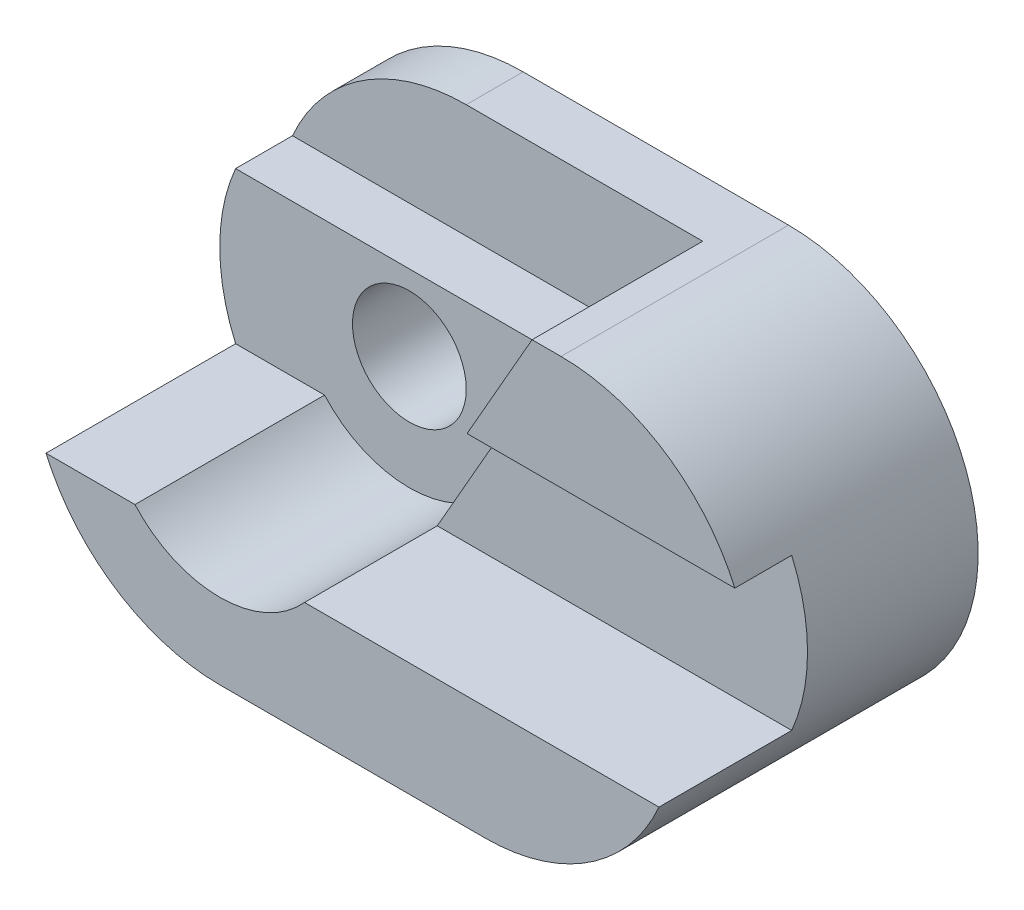
ISO-10303-21;
HEADER;
FILE_DESCRIPTION(('STEP AP214'),'2;1');
FILE_NAME('part.step','',(''),(''),'','','');
FILE_SCHEMA(('AUTOMOTIVE_DESIGN { 1 0 10303 214 1 1 1 1 }'));
ENDSEC;
DATA;
#1=APPLICATION_CONTEXT('core data for automotive mechanical design processes');
#2=APPLICATION_PROTOCOL_DEFINITION('international standard','automotive_design',2000,#1);
#3=PRODUCT_CONTEXT('',#1,'mechanical');
#4=PRODUCT('Part','Part','',(#3));
#5=PRODUCT_RELATED_PRODUCT_CATEGORY('part','',(#4));
#6=PRODUCT_DEFINITION_FORMATION('','',#4);
#7=PRODUCT_DEFINITION_CONTEXT('part definition',#1,'design');
#8=PRODUCT_DEFINITION('design','',#6,#7);
#9=PRODUCT_DEFINITION_SHAPE('','',#8);
#10=(LENGTH_UNIT() NAMED_UNIT(*) SI_UNIT(.MILLI.,.METRE.));
#11=(NAMED_UNIT(*) PLANE_ANGLE_UNIT() SI_UNIT($,.RADIAN.));
#12=(NAMED_UNIT(*) SI_UNIT($,.STERADIAN.) SOLID_ANGLE_UNIT());
#13=UNCERTAINTY_MEASURE_WITH_UNIT(LENGTH_MEASURE(1.E-05),#10,'distance_accuracy_value','');
#14=(GEOMETRIC_REPRESENTATION_CONTEXT(3) GLOBAL_UNCERTAINTY_ASSIGNED_CONTEXT((#13)) GLOBAL_UNIT_ASSIGNED_CONTEXT((#10,
#11,#12)) REPRESENTATION_CONTEXT('',''));
#15=CARTESIAN_POINT('',(0.,0.,0.));
#16=DIRECTION('',(0.,0.,1.));
#17=DIRECTION('',(1.,0.,0.));
#18=AXIS2_PLACEMENT_3D('',#15,#16,#17);
#19=CARTESIAN_POINT('',(-3.5,0.,8.));
#20=DIRECTION('',(0.,0.,-1.));
#21=DIRECTION('',(-1.,0.,0.));
#22=AXIS2_PLACEMENT_3D('',#19,#20,#21);
#23=CYLINDRICAL_SURFACE('',#22,1.5);
#24=CARTESIAN_POINT('',(-3.5,0.,0.));
#25=DIRECTION('',(0.,0.,1.));
#26=DIRECTION('',(1.,0.,0.));
#27=AXIS2_PLACEMENT_3D('',#24,#25,#26);
#28=CIRCLE('',#27,1.5);
#29=CARTESIAN_POINT('',(-2.,0.,0.));
#30=VERTEX_POINT('',#29);
#31=EDGE_CURVE('E197',#30,#30,#28,.T.);
#32=ORIENTED_EDGE('',*,*,#31,.F.);
#33=EDGE_LOOP('',(#32));
#34=FACE_BOUND('',#33,.T.);
#35=CARTESIAN_POINT('',(-3.5,0.,3.));
#36=DIRECTION('',(0.,0.,1.));
#37=DIRECTION('',(1.,0.,0.));
#38=AXIS2_PLACEMENT_3D('',#35,#36,#37);
#39=CIRCLE('',#38,1.5);
#40=CARTESIAN_POINT('',(-2.,0.,3.));
#41=VERTEX_POINT('',#40);
#42=EDGE_CURVE('E37',#41,#41,#39,.T.);
#43=ORIENTED_EDGE('',*,*,#42,.T.);
#44=EDGE_LOOP('',(#43));
#45=FACE_BOUND('',#44,.T.);
#46=ADVANCED_FACE('F33',(#34,#45),#23,.F.);
#47=CARTESIAN_POINT('',(18.,-2.,8.));
#48=DIRECTION('',(0.,1.,0.));
#49=DIRECTION('',(0.,0.,1.));
#50=AXIS2_PLACEMENT_3D('',#47,#48,#49);
#51=PLANE('',#50);
#52=DIRECTION('',(0.,0.,1.));
#53=VECTOR('',#52,1.);
#54=CARTESIAN_POINT('',(-5.73606797749979,-2.,3.));
#55=LINE('',#54,#53);
#56=CARTESIAN_POINT('',(-5.73606797749979,-2.,3.));
#57=VERTEX_POINT('',#56);
#58=CARTESIAN_POINT('',(-5.73606797749979,-2.,8.));
#59=VERTEX_POINT('',#58);
#60=EDGE_CURVE('E167',#57,#59,#55,.T.);
#61=ORIENTED_EDGE('',*,*,#60,.F.);
#62=DIRECTION('',(1.,0.,0.));
#63=VECTOR('',#62,1.);
#64=CARTESIAN_POINT('',(-10.7871921532877,-2.,3.));
#65=LINE('',#64,#63);
#66=CARTESIAN_POINT('',(-8.08257569495584,-2.,3.));
#67=VERTEX_POINT('',#66);
#68=EDGE_CURVE('E162',#67,#57,#65,.T.);
#69=ORIENTED_EDGE('',*,*,#68,.F.);
#70=DIRECTION('',(0.,0.,-1.));
#71=VECTOR('',#70,1.);
#72=CARTESIAN_POINT('',(-8.08257569495584,-2.,8.));
#73=LINE('',#72,#71);
#74=CARTESIAN_POINT('',(-8.08257569495584,-2.,8.));
#75=VERTEX_POINT('',#74);
#76=EDGE_CURVE('E194',#67,#75,#73,.F.);
#77=ORIENTED_EDGE('',*,*,#76,.T.);
#78=DIRECTION('',(-1.,0.,0.));
#79=VECTOR('',#78,1.);
#80=CARTESIAN_POINT('',(18.,-2.,8.));
#81=LINE('',#80,#79);
#82=EDGE_CURVE('E186',#59,#75,#81,.T.);
#83=ORIENTED_EDGE('',*,*,#82,.F.);
#84=EDGE_LOOP('',(#61,#69,#77,#83));
#85=FACE_BOUND('',#84,.T.);
#86=ADVANCED_FACE('F293',(#85),#51,.T.);
#87=CARTESIAN_POINT('',(-3.5,0.,8.));
#88=DIRECTION('',(0.,0.,1.));
#89=DIRECTION('',(1.,0.,0.));
#90=AXIS2_PLACEMENT_3D('',#87,#88,#89);
#91=PLANE('',#90);
#92=CARTESIAN_POINT('',(-3.5,0.,8.));
#93=DIRECTION('',(0.,0.,1.));
#94=DIRECTION('',(1.,0.,0.));
#95=AXIS2_PLACEMENT_3D('',#92,#93,#94);
#96=CIRCLE('',#95,3.);
#97=CARTESIAN_POINT('',(-1.26393202250021,-2.,8.));
#98=VERTEX_POINT('',#97);
#99=EDGE_CURVE('E156',#59,#98,#96,.T.);
#100=ORIENTED_EDGE('',*,*,#99,.F.);
#101=ORIENTED_EDGE('',*,*,#82,.T.);
#102=CARTESIAN_POINT('',(-3.5,0.,8.));
#103=DIRECTION('',(0.,0.,1.));
#104=DIRECTION('',(1.,0.,0.));
#105=AXIS2_PLACEMENT_3D('',#102,#103,#104);
#106=CIRCLE('',#105,5.);
#107=CARTESIAN_POINT('',(-3.5,-5.,8.));
#108=VERTEX_POINT('',#107);
#109=EDGE_CURVE('E201',#75,#108,#106,.T.);
#110=ORIENTED_EDGE('',*,*,#109,.T.);
#111=DIRECTION('',(1.,0.,0.));
#112=VECTOR('',#111,1.);
#113=CARTESIAN_POINT('',(-3.5,-5.,8.));
#114=LINE('',#113,#112);
#115=CARTESIAN_POINT('',(3.5,-5.,8.));
#116=VERTEX_POINT('',#115);
#117=EDGE_CURVE('E203',#108,#116,#114,.T.);
#118=ORIENTED_EDGE('',*,*,#117,.T.);
#119=CARTESIAN_POINT('',(3.5,0.,8.));
#120=DIRECTION('',(0.,0.,1.));
#121=DIRECTION('',(1.,0.,0.));
#122=AXIS2_PLACEMENT_3D('',#119,#120,#121);
#123=CIRCLE('',#122,5.);
#124=CARTESIAN_POINT('',(8.08257569495584,-2.,8.));
#125=VERTEX_POINT('',#124);
#126=EDGE_CURVE('E206',#116,#125,#123,.T.);
#127=ORIENTED_EDGE('',*,*,#126,.T.);
#128=EDGE_CURVE('E187',#125,#98,#81,.T.);
#129=ORIENTED_EDGE('',*,*,#128,.T.);
#130=EDGE_LOOP('',(#100,#101,#110,#118,#127,#129));
#131=FACE_BOUND('',#130,.T.);
#132=ADVANCED_FACE('F272',(#131),#91,.T.);
#133=CARTESIAN_POINT('',(-3.5,0.,8.));
#134=DIRECTION('',(0.,0.,-1.));
#135=DIRECTION('',(-1.,0.,0.));
#136=AXIS2_PLACEMENT_3D('',#133,#134,#135);
#137=CYLINDRICAL_SURFACE('',#136,5.);
#138=CARTESIAN_POINT('',(-3.5,0.,3.));
#139=DIRECTION('',(0.,0.,1.));
#140=DIRECTION('',(1.,0.,0.));
#141=AXIS2_PLACEMENT_3D('',#138,#139,#140);
#142=CIRCLE('',#141,5.);
#143=CARTESIAN_POINT('',(-8.08257569495584,2.,3.));
#144=VERTEX_POINT('',#143);
#145=EDGE_CURVE('E175',#144,#67,#142,.T.);
#146=ORIENTED_EDGE('',*,*,#145,.F.);
#147=DIRECTION('',(0.,0.,-1.));
#148=VECTOR('',#147,1.);
#149=CARTESIAN_POINT('',(-8.08257569495584,2.,8.));
#150=LINE('',#149,#148);
#151=CARTESIAN_POINT('',(-8.08257569495584,2.,1.5));
#152=VERTEX_POINT('',#151);
#153=EDGE_CURVE('E144',#144,#152,#150,.T.);
#154=ORIENTED_EDGE('',*,*,#153,.T.);
#155=CARTESIAN_POINT('',(-3.5,0.,1.5));
#156=DIRECTION('',(0.,0.,-1.));
#157=DIRECTION('',(-1.,0.,0.));
#158=AXIS2_PLACEMENT_3D('',#155,#156,#157);
#159=CIRCLE('',#158,5.);
#160=CARTESIAN_POINT('',(-3.5,5.,1.5));
#161=VERTEX_POINT('',#160);
#162=EDGE_CURVE('E136',#152,#161,#159,.T.);
#163=ORIENTED_EDGE('',*,*,#162,.T.);
#164=DIRECTION('',(0.,0.,-1.));
#165=VECTOR('',#164,1.);
#166=CARTESIAN_POINT('',(-3.5,5.,8.));
#167=LINE('',#166,#165);
#168=CARTESIAN_POINT('',(-3.5,5.,0.));
#169=VERTEX_POINT('',#168);
#170=EDGE_CURVE('E209',#161,#169,#167,.T.);
#171=ORIENTED_EDGE('',*,*,#170,.T.);
#172=CARTESIAN_POINT('',(-3.5,0.,0.));
#173=DIRECTION('',(0.,0.,1.));
#174=DIRECTION('',(1.,0.,0.));
#175=AXIS2_PLACEMENT_3D('',#172,#173,#174);
#176=CIRCLE('',#175,5.);
#177=CARTESIAN_POINT('',(-3.5,-5.,0.));
#178=VERTEX_POINT('',#177);
#179=EDGE_CURVE('E200',#169,#178,#176,.T.);
#180=ORIENTED_EDGE('',*,*,#179,.T.);
#181=DIRECTION('',(0.,0.,-1.));
#182=VECTOR('',#181,1.);
#183=CARTESIAN_POINT('',(-3.5,-5.,8.));
#184=LINE('',#183,#182);
#185=EDGE_CURVE('E225',#108,#178,#184,.T.);
#186=ORIENTED_EDGE('',*,*,#185,.F.);
#187=ORIENTED_EDGE('',*,*,#109,.F.);
#188=ORIENTED_EDGE('',*,*,#76,.F.);
#189=EDGE_LOOP('',(#146,#154,#163,#171,#180,#186,#187,#188));
#190=FACE_BOUND('',#189,.T.);
#191=ADVANCED_FACE('F35',(#190),#137,.T.);
#192=CARTESIAN_POINT('',(3.5,0.,8.));
#193=DIRECTION('',(0.,0.,-1.));
#194=DIRECTION('',(-1.,0.,0.));
#195=AXIS2_PLACEMENT_3D('',#192,#193,#194);
#196=CYLINDRICAL_SURFACE('',#195,5.);
#197=DIRECTION('',(0.,0.,-1.));
#198=VECTOR('',#197,1.);
#199=CARTESIAN_POINT('',(8.08257569495584,-2.,8.));
#200=LINE('',#199,#198);
#201=CARTESIAN_POINT('',(8.08257569495584,-2.,4.5));
#202=VERTEX_POINT('',#201);
#203=EDGE_CURVE('E42',#125,#202,#200,.T.);
#204=ORIENTED_EDGE('',*,*,#203,.F.);
#205=ORIENTED_EDGE('',*,*,#126,.F.);
#206=DIRECTION('',(0.,0.,-1.));
#207=VECTOR('',#206,1.);
#208=CARTESIAN_POINT('',(3.5,-5.,8.));
#209=LINE('',#208,#207);
#210=CARTESIAN_POINT('',(3.5,-5.,0.));
#211=VERTEX_POINT('',#210);
#212=EDGE_CURVE('E222',#116,#211,#209,.T.);
#213=ORIENTED_EDGE('',*,*,#212,.T.);
#214=CARTESIAN_POINT('',(3.5,0.,0.));
#215=DIRECTION('',(0.,0.,1.));
#216=DIRECTION('',(1.,0.,0.));
#217=AXIS2_PLACEMENT_3D('',#214,#215,#216);
#218=CIRCLE('',#217,5.);
#219=CARTESIAN_POINT('',(3.5,5.,0.));
#220=VERTEX_POINT('',#219);
#221=EDGE_CURVE('E214',#211,#220,#218,.T.);
#222=ORIENTED_EDGE('',*,*,#221,.T.);
#223=DIRECTION('',(0.,0.,-1.));
#224=VECTOR('',#223,1.);
#225=CARTESIAN_POINT('',(3.5,5.,8.));
#226=LINE('',#225,#224);
#227=CARTESIAN_POINT('',(3.5,5.,6.));
#228=VERTEX_POINT('',#227);
#229=EDGE_CURVE('E220',#228,#220,#226,.T.);
#230=ORIENTED_EDGE('',*,*,#229,.F.);
#231=CARTESIAN_POINT('',(3.5,0.,6.));
#232=DIRECTION('',(0.,0.,1.));
#233=DIRECTION('',(1.,0.,0.));
#234=AXIS2_PLACEMENT_3D('',#231,#232,#233);
#235=CIRCLE('',#234,5.);
#236=CARTESIAN_POINT('',(8.08257569495584,2.,6.));
#237=VERTEX_POINT('',#236);
#238=EDGE_CURVE('E192',#237,#228,#235,.T.);
#239=ORIENTED_EDGE('',*,*,#238,.F.);
#240=DIRECTION('',(0.,0.,-1.));
#241=VECTOR('',#240,1.);
#242=CARTESIAN_POINT('',(8.08257569495584,2.,8.));
#243=LINE('',#242,#241);
#244=CARTESIAN_POINT('',(8.08257569495584,2.,4.5));
#245=VERTEX_POINT('',#244);
#246=EDGE_CURVE('E231',#245,#237,#243,.F.);
#247=ORIENTED_EDGE('',*,*,#246,.F.);
#248=CARTESIAN_POINT('',(3.5,0.,4.5));
#249=DIRECTION('',(0.,0.,1.));
#250=DIRECTION('',(1.,0.,0.));
#251=AXIS2_PLACEMENT_3D('',#248,#249,#250);
#252=CIRCLE('',#251,5.);
#253=EDGE_CURVE('E190',#202,#245,#252,.T.);
#254=ORIENTED_EDGE('',*,*,#253,.F.);
#255=EDGE_LOOP('',(#204,#205,#213,#222,#230,#239,#247,#254));
#256=FACE_BOUND('',#255,.T.);
#257=ADVANCED_FACE('F246',(#256),#196,.T.);
#258=CARTESIAN_POINT('',(-3.5,5.,8.));
#259=DIRECTION('',(0.,-1.,0.));
#260=DIRECTION('',(1.,0.,0.));
#261=AXIS2_PLACEMENT_3D('',#258,#259,#260);
#262=PLANE('',#261);
#263=DIRECTION('',(-1.,0.,0.));
#264=VECTOR('',#263,1.);
#265=CARTESIAN_POINT('',(2.73606797749979,5.,1.5));
#266=LINE('',#265,#264);
#267=CARTESIAN_POINT('',(2.73606797749979,5.,1.5));
#268=VERTEX_POINT('',#267);
#269=EDGE_CURVE('E145',#268,#161,#266,.T.);
#270=ORIENTED_EDGE('',*,*,#269,.F.);
#271=DIRECTION('',(0.,0.,1.));
#272=VECTOR('',#271,1.);
#273=CARTESIAN_POINT('',(2.73606797749979,5.,3.));
#274=LINE('',#273,#272);
#275=CARTESIAN_POINT('',(2.73606797749979,5.,6.));
#276=VERTEX_POINT('',#275);
#277=EDGE_CURVE('E149',#268,#276,#274,.T.);
#278=ORIENTED_EDGE('',*,*,#277,.T.);
#279=DIRECTION('',(-1.,0.,0.));
#280=VECTOR('',#279,1.);
#281=CARTESIAN_POINT('',(-3.5,5.,6.));
#282=LINE('',#281,#280);
#283=EDGE_CURVE('E228',#228,#276,#282,.T.);
#284=ORIENTED_EDGE('',*,*,#283,.F.);
#285=ORIENTED_EDGE('',*,*,#229,.T.);
#286=DIRECTION('',(-1.,0.,0.));
#287=VECTOR('',#286,1.);
#288=CARTESIAN_POINT('',(-3.5,5.,0.));
#289=LINE('',#288,#287);
#290=EDGE_CURVE('E204',#220,#169,#289,.T.);
#291=ORIENTED_EDGE('',*,*,#290,.T.);
#292=ORIENTED_EDGE('',*,*,#170,.F.);
#293=EDGE_LOOP('',(#270,#278,#284,#285,#291,#292));
#294=FACE_BOUND('',#293,.T.);
#295=ADVANCED_FACE('F258',(#294),#262,.F.);
#296=CARTESIAN_POINT('',(-3.5,0.,0.));
#297=DIRECTION('',(0.,0.,1.));
#298=DIRECTION('',(1.,0.,0.));
#299=AXIS2_PLACEMENT_3D('',#296,#297,#298);
#300=PLANE('',#299);
#301=ORIENTED_EDGE('',*,*,#179,.F.);
#302=ORIENTED_EDGE('',*,*,#290,.F.);
#303=ORIENTED_EDGE('',*,*,#221,.F.);
#304=DIRECTION('',(1.,0.,0.));
#305=VECTOR('',#304,1.);
#306=CARTESIAN_POINT('',(-3.5,-5.,0.));
#307=LINE('',#306,#305);
#308=EDGE_CURVE('E212',#178,#211,#307,.T.);
#309=ORIENTED_EDGE('',*,*,#308,.F.);
#310=EDGE_LOOP('',(#301,#302,#303,#309));
#311=FACE_BOUND('',#310,.T.);
#312=ORIENTED_EDGE('',*,*,#31,.T.);
#313=EDGE_LOOP('',(#312));
#314=FACE_BOUND('',#313,.T.);
#315=ADVANCED_FACE('F281',(#311,#314),#300,.F.);
#316=CARTESIAN_POINT('',(-3.5,-5.,8.));
#317=DIRECTION('',(0.,1.,0.));
#318=DIRECTION('',(-1.,0.,0.));
#319=AXIS2_PLACEMENT_3D('',#316,#317,#318);
#320=PLANE('',#319);
#321=ORIENTED_EDGE('',*,*,#308,.T.);
#322=ORIENTED_EDGE('',*,*,#212,.F.);
#323=ORIENTED_EDGE('',*,*,#117,.F.);
#324=ORIENTED_EDGE('',*,*,#185,.T.);
#325=EDGE_LOOP('',(#321,#322,#323,#324));
#326=FACE_BOUND('',#325,.T.);
#327=ADVANCED_FACE('F285',(#326),#320,.F.);
#328=DIRECTION('',(0.,0.,1.));
#329=VECTOR('',#328,1.);
#330=CARTESIAN_POINT('',(-1.26393202250021,-2.,3.));
#331=LINE('',#330,#329);
#332=CARTESIAN_POINT('',(-1.26393202250021,-2.,4.5));
#333=VERTEX_POINT('',#332);
#334=EDGE_CURVE('E165',#333,#98,#331,.T.);
#335=ORIENTED_EDGE('',*,*,#334,.T.);
#336=ORIENTED_EDGE('',*,*,#128,.F.);
#337=ORIENTED_EDGE('',*,*,#203,.T.);
#338=DIRECTION('',(-1.,0.,0.));
#339=VECTOR('',#338,1.);
#340=CARTESIAN_POINT('',(18.,-2.,4.5));
#341=LINE('',#340,#339);
#342=EDGE_CURVE('E183',#202,#333,#341,.T.);
#343=ORIENTED_EDGE('',*,*,#342,.T.);
#344=EDGE_LOOP('',(#335,#336,#337,#343));
#345=FACE_BOUND('',#344,.T.);
#346=ADVANCED_FACE('F237',(#345),#51,.T.);
#347=CARTESIAN_POINT('',(18.,2.,4.5));
#348=DIRECTION('',(0.,-1.,0.));
#349=DIRECTION('',(0.,0.,-1.));
#350=AXIS2_PLACEMENT_3D('',#347,#348,#349);
#351=PLANE('',#350);
#352=DIRECTION('',(0.,0.,1.));
#353=VECTOR('',#352,1.);
#354=CARTESIAN_POINT('',(1.02178226321407,2.,4.5));
#355=LINE('',#354,#353);
#356=CARTESIAN_POINT('',(1.02178226321407,2.,4.5));
#357=VERTEX_POINT('',#356);
#358=CARTESIAN_POINT('',(1.02178226321407,2.,6.));
#359=VERTEX_POINT('',#358);
#360=EDGE_CURVE('E169',#357,#359,#355,.T.);
#361=ORIENTED_EDGE('',*,*,#360,.F.);
#362=DIRECTION('',(-1.,0.,0.));
#363=VECTOR('',#362,1.);
#364=CARTESIAN_POINT('',(18.,2.,4.5));
#365=LINE('',#364,#363);
#366=EDGE_CURVE('E180',#245,#357,#365,.T.);
#367=ORIENTED_EDGE('',*,*,#366,.F.);
#368=ORIENTED_EDGE('',*,*,#246,.T.);
#369=DIRECTION('',(-1.,0.,0.));
#370=VECTOR('',#369,1.);
#371=CARTESIAN_POINT('',(18.,2.,6.));
#372=LINE('',#371,#370);
#373=EDGE_CURVE('E177',#237,#359,#372,.T.);
#374=ORIENTED_EDGE('',*,*,#373,.T.);
#375=EDGE_LOOP('',(#361,#367,#368,#374));
#376=FACE_BOUND('',#375,.T.);
#377=ADVANCED_FACE('F252',(#376),#351,.T.);
#378=CARTESIAN_POINT('',(18.,2.,6.));
#379=DIRECTION('',(0.,0.,1.));
#380=DIRECTION('',(1.,0.,0.));
#381=AXIS2_PLACEMENT_3D('',#378,#379,#380);
#382=PLANE('',#381);
#383=DIRECTION('',(0.496138938356834,0.868243142124459,0.));
#384=VECTOR('',#383,1.);
#385=CARTESIAN_POINT('',(5.20103585996138,9.31369379430778,6.));
#386=LINE('',#385,#384);
#387=EDGE_CURVE('E173',#359,#276,#386,.T.);
#388=ORIENTED_EDGE('',*,*,#387,.F.);
#389=ORIENTED_EDGE('',*,*,#373,.F.);
#390=ORIENTED_EDGE('',*,*,#238,.T.);
#391=ORIENTED_EDGE('',*,*,#283,.T.);
#392=EDGE_LOOP('',(#388,#389,#390,#391));
#393=FACE_BOUND('',#392,.T.);
#394=ADVANCED_FACE('F255',(#393),#382,.T.);
#395=CARTESIAN_POINT('',(18.,-2.,4.5));
#396=DIRECTION('',(0.,0.,1.));
#397=DIRECTION('',(1.,0.,0.));
#398=AXIS2_PLACEMENT_3D('',#395,#396,#397);
#399=PLANE('',#398);
#400=DIRECTION('',(0.496138938356834,0.868243142124459,0.));
#401=VECTOR('',#400,1.);
#402=CARTESIAN_POINT('',(3.47795893688445,6.29830917892317,4.5));
#403=LINE('',#402,#401);
#404=EDGE_CURVE('E11',#333,#357,#403,.T.);
#405=ORIENTED_EDGE('',*,*,#404,.F.);
#406=ORIENTED_EDGE('',*,*,#342,.F.);
#407=ORIENTED_EDGE('',*,*,#253,.T.);
#408=ORIENTED_EDGE('',*,*,#366,.T.);
#409=EDGE_LOOP('',(#405,#406,#407,#408));
#410=FACE_BOUND('',#409,.T.);
#411=ADVANCED_FACE('F243',(#410),#399,.T.);
#412=CARTESIAN_POINT('',(-3.5,0.,3.));
#413=DIRECTION('',(0.,0.,1.));
#414=DIRECTION('',(1.,0.,0.));
#415=AXIS2_PLACEMENT_3D('',#412,#413,#414);
#416=PLANE('',#415);
#417=DIRECTION('',(1.,0.,0.));
#418=VECTOR('',#417,1.);
#419=CARTESIAN_POINT('',(-9.19941409392218,2.,3.));
#420=LINE('',#419,#418);
#421=CARTESIAN_POINT('',(1.02178226321407,2.,3.));
#422=VERTEX_POINT('',#421);
#423=EDGE_CURVE('E139',#144,#422,#420,.T.);
#424=ORIENTED_EDGE('',*,*,#423,.F.);
#425=ORIENTED_EDGE('',*,*,#145,.T.);
#426=ORIENTED_EDGE('',*,*,#68,.T.);
#427=CARTESIAN_POINT('',(-3.5,0.,3.));
#428=DIRECTION('',(0.,0.,1.));
#429=DIRECTION('',(1.,0.,0.));
#430=AXIS2_PLACEMENT_3D('',#427,#428,#429);
#431=CIRCLE('',#430,3.);
#432=CARTESIAN_POINT('',(-1.26393202250021,-2.,3.));
#433=VERTEX_POINT('',#432);
#434=EDGE_CURVE('E157',#57,#433,#431,.T.);
#435=ORIENTED_EDGE('',*,*,#434,.T.);
#436=DIRECTION('',(0.496138938356834,0.868243142124459,0.));
#437=VECTOR('',#436,1.);
#438=CARTESIAN_POINT('',(-1.26393202250021,-2.,3.));
#439=LINE('',#438,#437);
#440=EDGE_CURVE('E160',#433,#422,#439,.T.);
#441=ORIENTED_EDGE('',*,*,#440,.T.);
#442=EDGE_LOOP('',(#424,#425,#426,#435,#441));
#443=FACE_BOUND('',#442,.T.);
#444=ORIENTED_EDGE('',*,*,#42,.F.);
#445=EDGE_LOOP('',(#444));
#446=FACE_BOUND('',#445,.T.);
#447=ADVANCED_FACE('F264',(#443,#446),#416,.T.);
#448=CARTESIAN_POINT('',(-3.5,0.,3.));
#449=DIRECTION('',(0.,0.,1.));
#450=DIRECTION('',(1.,0.,0.));
#451=AXIS2_PLACEMENT_3D('',#448,#449,#450);
#452=CYLINDRICAL_SURFACE('',#451,3.);
#453=ORIENTED_EDGE('',*,*,#99,.T.);
#454=ORIENTED_EDGE('',*,*,#334,.F.);
#455=EDGE_CURVE('E54',#433,#333,#331,.T.);
#456=ORIENTED_EDGE('',*,*,#455,.F.);
#457=ORIENTED_EDGE('',*,*,#434,.F.);
#458=ORIENTED_EDGE('',*,*,#60,.T.);
#459=EDGE_LOOP('',(#453,#454,#456,#457,#458));
#460=FACE_BOUND('',#459,.T.);
#461=ADVANCED_FACE('F269',(#460),#452,.F.);
#462=CARTESIAN_POINT('',(-1.26393202250021,-2.,3.));
#463=DIRECTION('',(0.868243142124459,-0.496138938356834,0.));
#464=DIRECTION('',(0.496138938356834,0.868243142124459,0.));
#465=AXIS2_PLACEMENT_3D('',#462,#463,#464);
#466=PLANE('',#465);
#467=ORIENTED_EDGE('',*,*,#387,.T.);
#468=ORIENTED_EDGE('',*,*,#277,.F.);
#469=DIRECTION('',(0.496138938356834,0.868243142124459,0.));
#470=VECTOR('',#469,1.);
#471=CARTESIAN_POINT('',(1.02178226321407,2.,1.5));
#472=LINE('',#471,#470);
#473=CARTESIAN_POINT('',(1.02178226321407,2.,1.5));
#474=VERTEX_POINT('',#473);
#475=EDGE_CURVE('E133',#474,#268,#472,.T.);
#476=ORIENTED_EDGE('',*,*,#475,.F.);
#477=DIRECTION('',(0.,0.,1.));
#478=VECTOR('',#477,1.);
#479=CARTESIAN_POINT('',(1.02178226321407,2.,1.5));
#480=LINE('',#479,#478);
#481=EDGE_CURVE('E49',#474,#422,#480,.T.);
#482=ORIENTED_EDGE('',*,*,#481,.T.);
#483=ORIENTED_EDGE('',*,*,#440,.F.);
#484=ORIENTED_EDGE('',*,*,#455,.T.);
#485=ORIENTED_EDGE('',*,*,#404,.T.);
#486=ORIENTED_EDGE('',*,*,#360,.T.);
#487=EDGE_LOOP('',(#467,#468,#476,#482,#483,#484,#485,#486));
#488=FACE_BOUND('',#487,.T.);
#489=ADVANCED_FACE('F147',(#488),#466,.F.);
#490=CARTESIAN_POINT('',(0.,0.,1.5));
#491=DIRECTION('',(0.,0.,-1.));
#492=DIRECTION('',(-1.,0.,0.));
#493=AXIS2_PLACEMENT_3D('',#490,#491,#492);
#494=PLANE('',#493);
#495=DIRECTION('',(1.,0.,0.));
#496=VECTOR('',#495,1.);
#497=CARTESIAN_POINT('',(-9.19941409392218,2.,1.5));
#498=LINE('',#497,#496);
#499=EDGE_CURVE('E131',#152,#474,#498,.T.);
#500=ORIENTED_EDGE('',*,*,#499,.T.);
#501=ORIENTED_EDGE('',*,*,#475,.T.);
#502=ORIENTED_EDGE('',*,*,#269,.T.);
#503=ORIENTED_EDGE('',*,*,#162,.F.);
#504=EDGE_LOOP('',(#500,#501,#502,#503));
#505=FACE_BOUND('',#504,.T.);
#506=ADVANCED_FACE('F132',(#505),#494,.F.);
#507=CARTESIAN_POINT('',(-9.19941409392218,2.,1.5));
#508=DIRECTION('',(0.,-1.,0.));
#509=DIRECTION('',(0.,0.,-1.));
#510=AXIS2_PLACEMENT_3D('',#507,#508,#509);
#511=PLANE('',#510);
#512=ORIENTED_EDGE('',*,*,#423,.T.);
#513=ORIENTED_EDGE('',*,*,#481,.F.);
#514=ORIENTED_EDGE('',*,*,#499,.F.);
#515=ORIENTED_EDGE('',*,*,#153,.F.);
#516=EDGE_LOOP('',(#512,#513,#514,#515));
#517=FACE_BOUND('',#516,.T.);
#518=ADVANCED_FACE('F141',(#517),#511,.F.);
#519=CLOSED_SHELL('',(#46,#86,#132,#191,#257,#295,#315,#327,#346,#377,#394,#411,#447,#461,#489,
#506,#518));
#520=MANIFOLD_SOLID_BREP('B2',#519);
#521=ADVANCED_BREP_SHAPE_REPRESENTATION('',(#18,#520),#14);
#522=SHAPE_DEFINITION_REPRESENTATION(#9,#521);
ENDSEC;
END-ISO-10303-21;
